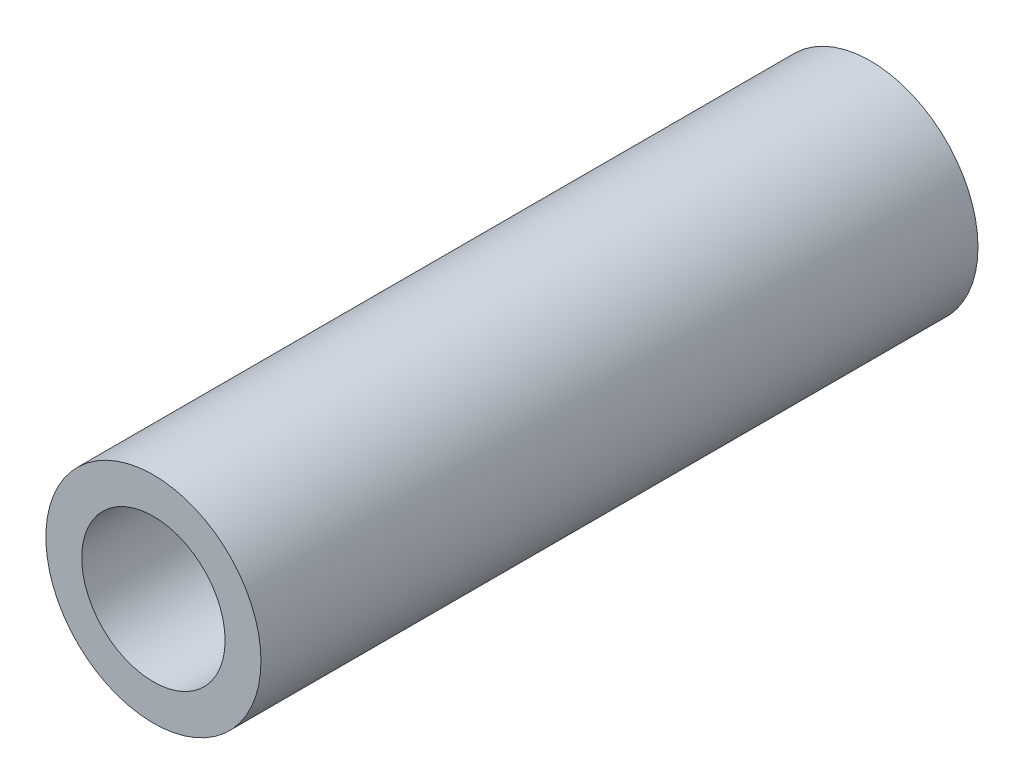
ISO-10303-21;
HEADER;
FILE_DESCRIPTION(('STEP AP214'),'2;1');
FILE_NAME('part.step','',(''),(''),'','','');
FILE_SCHEMA(('AUTOMOTIVE_DESIGN { 1 0 10303 214 1 1 1 1 }'));
ENDSEC;
DATA;
#1=APPLICATION_CONTEXT('core data for automotive mechanical design processes');
#2=APPLICATION_PROTOCOL_DEFINITION('international standard','automotive_design',2000,#1);
#3=PRODUCT_CONTEXT('',#1,'mechanical');
#4=PRODUCT('Part','Part','',(#3));
#5=PRODUCT_RELATED_PRODUCT_CATEGORY('part','',(#4));
#6=PRODUCT_DEFINITION_FORMATION('','',#4);
#7=PRODUCT_DEFINITION_CONTEXT('part definition',#1,'design');
#8=PRODUCT_DEFINITION('design','',#6,#7);
#9=PRODUCT_DEFINITION_SHAPE('','',#8);
#10=(LENGTH_UNIT() NAMED_UNIT(*) SI_UNIT(.MILLI.,.METRE.));
#11=(NAMED_UNIT(*) PLANE_ANGLE_UNIT() SI_UNIT($,.RADIAN.));
#12=(NAMED_UNIT(*) SI_UNIT($,.STERADIAN.) SOLID_ANGLE_UNIT());
#13=UNCERTAINTY_MEASURE_WITH_UNIT(LENGTH_MEASURE(1.E-05),#10,'distance_accuracy_value','');
#14=(GEOMETRIC_REPRESENTATION_CONTEXT(3) GLOBAL_UNCERTAINTY_ASSIGNED_CONTEXT((#13)) GLOBAL_UNIT_ASSIGNED_CONTEXT((#10,
#11,#12)) REPRESENTATION_CONTEXT('',''));
#15=CARTESIAN_POINT('',(0.,0.,0.));
#16=DIRECTION('',(0.,0.,1.));
#17=DIRECTION('',(1.,0.,0.));
#18=AXIS2_PLACEMENT_3D('',#15,#16,#17);
#19=CARTESIAN_POINT('',(0.,0.,20.));
#20=DIRECTION('',(0.,0.,1.));
#21=DIRECTION('',(1.,0.,0.));
#22=AXIS2_PLACEMENT_3D('',#19,#20,#21);
#23=PLANE('',#22);
#24=CARTESIAN_POINT('',(0.,0.,20.));
#25=DIRECTION('',(0.,0.,1.));
#26=DIRECTION('',(1.,0.,0.));
#27=AXIS2_PLACEMENT_3D('',#24,#25,#26);
#28=CIRCLE('',#27,3.);
#29=CARTESIAN_POINT('',(3.,0.,20.));
#30=VERTEX_POINT('',#29);
#31=EDGE_CURVE('E38',#30,#30,#28,.T.);
#32=ORIENTED_EDGE('',*,*,#31,.T.);
#33=EDGE_LOOP('',(#32));
#34=FACE_BOUND('',#33,.T.);
#35=CARTESIAN_POINT('',(0.,0.,20.));
#36=DIRECTION('',(0.,0.,1.));
#37=DIRECTION('',(1.,0.,0.));
#38=AXIS2_PLACEMENT_3D('',#35,#36,#37);
#39=CIRCLE('',#38,2.);
#40=CARTESIAN_POINT('',(2.,0.,20.));
#41=VERTEX_POINT('',#40);
#42=EDGE_CURVE('E47',#41,#41,#39,.T.);
#43=ORIENTED_EDGE('',*,*,#42,.F.);
#44=EDGE_LOOP('',(#43));
#45=FACE_BOUND('',#44,.T.);
#46=ADVANCED_FACE('F31',(#34,#45),#23,.T.);
#47=CARTESIAN_POINT('',(0.,0.,0.));
#48=DIRECTION('',(0.,0.,1.));
#49=DIRECTION('',(1.,0.,0.));
#50=AXIS2_PLACEMENT_3D('',#47,#48,#49);
#51=PLANE('',#50);
#52=CARTESIAN_POINT('',(0.,0.,0.));
#53=DIRECTION('',(0.,0.,1.));
#54=DIRECTION('',(1.,0.,0.));
#55=AXIS2_PLACEMENT_3D('',#52,#53,#54);
#56=CIRCLE('',#55,3.);
#57=CARTESIAN_POINT('',(3.,0.,0.));
#58=VERTEX_POINT('',#57);
#59=EDGE_CURVE('E42',#58,#58,#56,.T.);
#60=ORIENTED_EDGE('',*,*,#59,.F.);
#61=EDGE_LOOP('',(#60));
#62=FACE_BOUND('',#61,.T.);
#63=ADVANCED_FACE('F55',(#62),#51,.F.);
#64=CARTESIAN_POINT('',(0.,0.,20.));
#65=DIRECTION('',(0.,0.,-1.));
#66=DIRECTION('',(-1.,0.,0.));
#67=AXIS2_PLACEMENT_3D('',#64,#65,#66);
#68=CYLINDRICAL_SURFACE('',#67,3.);
#69=ORIENTED_EDGE('',*,*,#31,.F.);
#70=EDGE_LOOP('',(#69));
#71=FACE_BOUND('',#70,.T.);
#72=ORIENTED_EDGE('',*,*,#59,.T.);
#73=EDGE_LOOP('',(#72));
#74=FACE_BOUND('',#73,.T.);
#75=ADVANCED_FACE('F33',(#71,#74),#68,.T.);
#76=CARTESIAN_POINT('',(0.,0.,20.));
#77=DIRECTION('',(0.,0.,-1.));
#78=DIRECTION('',(-1.,0.,0.));
#79=AXIS2_PLACEMENT_3D('',#76,#77,#78);
#80=CYLINDRICAL_SURFACE('',#79,2.);
#81=CARTESIAN_POINT('',(0.,0.,10.));
#82=DIRECTION('',(0.,0.,1.));
#83=DIRECTION('',(1.,0.,0.));
#84=AXIS2_PLACEMENT_3D('',#81,#82,#83);
#85=CIRCLE('',#84,2.);
#86=CARTESIAN_POINT('',(2.,0.,10.));
#87=VERTEX_POINT('',#86);
#88=EDGE_CURVE('E10',#87,#87,#85,.T.);
#89=ORIENTED_EDGE('',*,*,#88,.F.);
#90=EDGE_LOOP('',(#89));
#91=FACE_BOUND('',#90,.T.);
#92=ORIENTED_EDGE('',*,*,#42,.T.);
#93=EDGE_LOOP('',(#92));
#94=FACE_BOUND('',#93,.T.);
#95=ADVANCED_FACE('F52',(#91,#94),#80,.F.);
#96=CARTESIAN_POINT('',(0.,0.,10.));
#97=DIRECTION('',(0.,0.,1.));
#98=DIRECTION('',(1.,0.,0.));
#99=AXIS2_PLACEMENT_3D('',#96,#97,#98);
#100=PLANE('',#99);
#101=ORIENTED_EDGE('',*,*,#88,.T.);
#102=EDGE_LOOP('',(#101));
#103=FACE_BOUND('',#102,.T.);
#104=ADVANCED_FACE('F64',(#103),#100,.T.);
#105=CLOSED_SHELL('',(#46,#63,#75,#95,#104));
#106=MANIFOLD_SOLID_BREP('B2',#105);
#107=ADVANCED_BREP_SHAPE_REPRESENTATION('',(#18,#106),#14);
#108=SHAPE_DEFINITION_REPRESENTATION(#9,#107);
ENDSEC;
END-ISO-10303-21;
